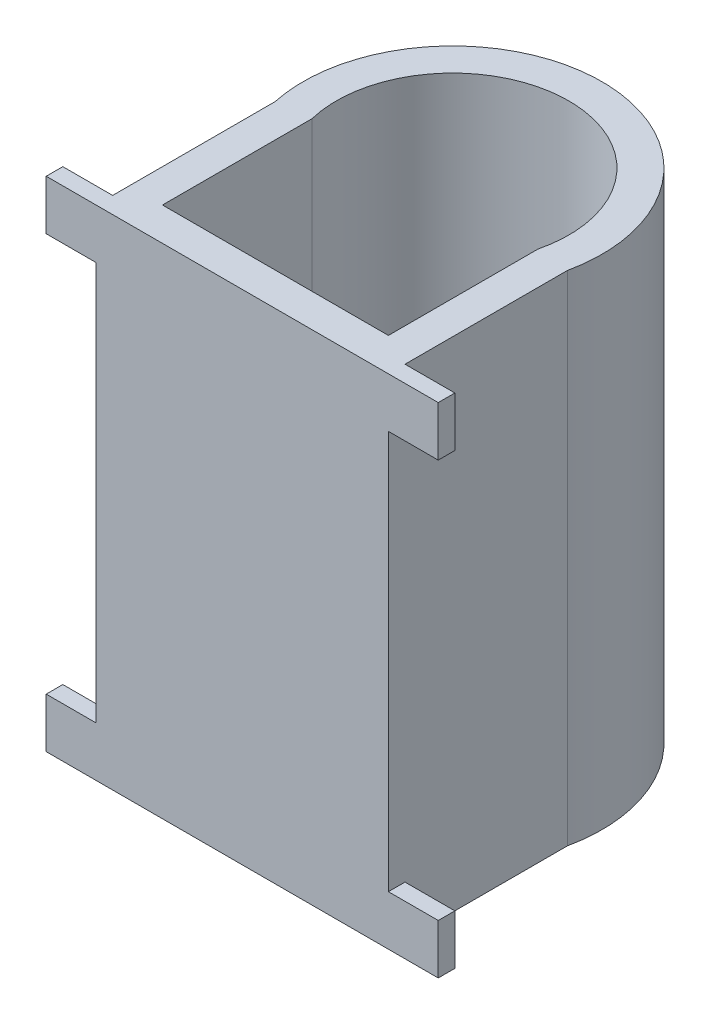
ISO-10303-21;
HEADER;
FILE_DESCRIPTION(('STEP AP214'),'2;1');
FILE_NAME('part.step','',(''),(''),'','','');
FILE_SCHEMA(('AUTOMOTIVE_DESIGN { 1 0 10303 214 1 1 1 1 }'));
ENDSEC;
DATA;
#1=APPLICATION_CONTEXT('core data for automotive mechanical design processes');
#2=APPLICATION_PROTOCOL_DEFINITION('international standard','automotive_design',2000,#1);
#3=PRODUCT_CONTEXT('',#1,'mechanical');
#4=PRODUCT('Part','Part','',(#3));
#5=PRODUCT_RELATED_PRODUCT_CATEGORY('part','',(#4));
#6=PRODUCT_DEFINITION_FORMATION('','',#4);
#7=PRODUCT_DEFINITION_CONTEXT('part definition',#1,'design');
#8=PRODUCT_DEFINITION('design','',#6,#7);
#9=PRODUCT_DEFINITION_SHAPE('','',#8);
#10=(LENGTH_UNIT() NAMED_UNIT(*) SI_UNIT(.MILLI.,.METRE.));
#11=(NAMED_UNIT(*) PLANE_ANGLE_UNIT() SI_UNIT($,.RADIAN.));
#12=(NAMED_UNIT(*) SI_UNIT($,.STERADIAN.) SOLID_ANGLE_UNIT());
#13=UNCERTAINTY_MEASURE_WITH_UNIT(LENGTH_MEASURE(1.E-05),#10,'distance_accuracy_value','');
#14=(GEOMETRIC_REPRESENTATION_CONTEXT(3) GLOBAL_UNCERTAINTY_ASSIGNED_CONTEXT((#13)) GLOBAL_UNIT_ASSIGNED_CONTEXT((#10,
#11,#12)) REPRESENTATION_CONTEXT('',''));
#15=CARTESIAN_POINT('',(0.,0.,0.));
#16=DIRECTION('',(0.,0.,1.));
#17=DIRECTION('',(1.,0.,0.));
#18=AXIS2_PLACEMENT_3D('',#15,#16,#17);
#19=CARTESIAN_POINT('',(40.4131170098748,150.,22.5));
#20=DIRECTION('',(-1.,0.,0.));
#21=DIRECTION('',(0.,0.,1.));
#22=AXIS2_PLACEMENT_3D('',#19,#20,#21);
#23=PLANE('',#22);
#24=DIRECTION('',(0.,0.,1.));
#25=VECTOR('',#24,1.);
#26=CARTESIAN_POINT('',(40.4131170098748,15.,27.5));
#27=LINE('',#26,#25);
#28=CARTESIAN_POINT('',(40.4131170098748,15.,27.5));
#29=VERTEX_POINT('',#28);
#30=CARTESIAN_POINT('',(40.4131170098748,15.,32.5));
#31=VERTEX_POINT('',#30);
#32=EDGE_CURVE('P0_E101',#29,#31,#27,.T.);
#33=ORIENTED_EDGE('',*,*,#32,.F.);
#34=DIRECTION('',(0.,1.,0.));
#35=VECTOR('',#34,1.);
#36=CARTESIAN_POINT('',(40.4131170098748,150.,27.5));
#37=LINE('',#36,#35);
#38=CARTESIAN_POINT('',(40.4131170098748,0.,27.5));
#39=VERTEX_POINT('',#38);
#40=EDGE_CURVE('P0_E105',#39,#29,#37,.T.);
#41=ORIENTED_EDGE('',*,*,#40,.F.);
#42=DIRECTION('',(0.,0.,-1.));
#43=VECTOR('',#42,1.);
#44=CARTESIAN_POINT('',(40.4131170098748,0.,22.5));
#45=LINE('',#44,#43);
#46=CARTESIAN_POINT('',(40.4131170098748,0.,-21.3726427308615));
#47=VERTEX_POINT('',#46);
#48=EDGE_CURVE('P0_E229',#39,#47,#45,.T.);
#49=ORIENTED_EDGE('',*,*,#48,.T.);
#50=DIRECTION('',(0.,-1.,0.));
#51=VECTOR('',#50,1.);
#52=CARTESIAN_POINT('',(40.4131170098748,150.,-21.3726427308615));
#53=LINE('',#52,#51);
#54=CARTESIAN_POINT('',(40.4131170098748,150.,-21.3726427308615));
#55=VERTEX_POINT('',#54);
#56=EDGE_CURVE('P0_E413',#55,#47,#53,.T.);
#57=ORIENTED_EDGE('',*,*,#56,.F.);
#58=DIRECTION('',(0.,0.,-1.));
#59=VECTOR('',#58,1.);
#60=CARTESIAN_POINT('',(40.4131170098748,150.,22.5));
#61=LINE('',#60,#59);
#62=CARTESIAN_POINT('',(40.4131170098748,150.,27.5));
#63=VERTEX_POINT('',#62);
#64=EDGE_CURVE('P0_E410',#63,#55,#61,.T.);
#65=ORIENTED_EDGE('',*,*,#64,.F.);
#66=DIRECTION('',(0.,-1.,0.));
#67=VECTOR('',#66,1.);
#68=CARTESIAN_POINT('',(40.4131170098748,150.,27.5));
#69=LINE('',#68,#67);
#70=CARTESIAN_POINT('',(40.4131170098748,135.,27.5));
#71=VERTEX_POINT('',#70);
#72=EDGE_CURVE('P0_E304',#63,#71,#69,.T.);
#73=ORIENTED_EDGE('',*,*,#72,.T.);
#74=DIRECTION('',(0.,0.,1.));
#75=VECTOR('',#74,1.);
#76=CARTESIAN_POINT('',(40.4131170098748,135.,27.5));
#77=LINE('',#76,#75);
#78=CARTESIAN_POINT('',(40.4131170098748,135.,32.5));
#79=VERTEX_POINT('',#78);
#80=EDGE_CURVE('P0_E288',#71,#79,#77,.T.);
#81=ORIENTED_EDGE('',*,*,#80,.T.);
#82=DIRECTION('',(0.,-1.,0.));
#83=VECTOR('',#82,1.);
#84=CARTESIAN_POINT('',(40.4131170098748,150.,32.5));
#85=LINE('',#84,#83);
#86=EDGE_CURVE('P0_E429',#79,#31,#85,.T.);
#87=ORIENTED_EDGE('',*,*,#86,.T.);
#88=EDGE_LOOP('',(#33,#41,#49,#57,#65,#73,#81,#87));
#89=FACE_BOUND('',#88,.T.);
#90=ADVANCED_FACE('P0_F85',(#89),#23,.F.);
#91=CARTESIAN_POINT('',(-47.5868829901252,150.,22.5));
#92=DIRECTION('',(1.,0.,0.));
#93=DIRECTION('',(0.,0.,-1.));
#94=AXIS2_PLACEMENT_3D('',#91,#92,#93);
#95=PLANE('',#94);
#96=DIRECTION('',(0.,0.,1.));
#97=VECTOR('',#96,1.);
#98=CARTESIAN_POINT('',(-47.5868829901252,15.,27.5));
#99=LINE('',#98,#97);
#100=CARTESIAN_POINT('',(-47.5868829901252,15.,27.5));
#101=VERTEX_POINT('',#100);
#102=CARTESIAN_POINT('',(-47.5868829901252,15.,32.5));
#103=VERTEX_POINT('',#102);
#104=EDGE_CURVE('P0_E279',#101,#103,#99,.T.);
#105=ORIENTED_EDGE('',*,*,#104,.T.);
#106=DIRECTION('',(0.,-1.,0.));
#107=VECTOR('',#106,1.);
#108=CARTESIAN_POINT('',(-47.5868829901252,150.,32.5));
#109=LINE('',#108,#107);
#110=CARTESIAN_POINT('',(-47.5868829901252,135.,32.5));
#111=VERTEX_POINT('',#110);
#112=EDGE_CURVE('P0_E94',#111,#103,#109,.T.);
#113=ORIENTED_EDGE('',*,*,#112,.F.);
#114=DIRECTION('',(0.,0.,1.));
#115=VECTOR('',#114,1.);
#116=CARTESIAN_POINT('',(-47.5868829901252,135.,27.5));
#117=LINE('',#116,#115);
#118=CARTESIAN_POINT('',(-47.5868829901252,135.,27.5));
#119=VERTEX_POINT('',#118);
#120=EDGE_CURVE('P0_E345',#119,#111,#117,.T.);
#121=ORIENTED_EDGE('',*,*,#120,.F.);
#122=DIRECTION('',(0.,1.,0.));
#123=VECTOR('',#122,1.);
#124=CARTESIAN_POINT('',(-47.5868829901252,150.,27.5));
#125=LINE('',#124,#123);
#126=CARTESIAN_POINT('',(-47.5868829901252,150.,27.5));
#127=VERTEX_POINT('',#126);
#128=EDGE_CURVE('P0_E322',#119,#127,#125,.T.);
#129=ORIENTED_EDGE('',*,*,#128,.T.);
#130=DIRECTION('',(0.,0.,1.));
#131=VECTOR('',#130,1.);
#132=CARTESIAN_POINT('',(-47.5868829901252,150.,22.5));
#133=LINE('',#132,#131);
#134=CARTESIAN_POINT('',(-47.5868829901252,150.,-21.3726427308615));
#135=VERTEX_POINT('',#134);
#136=EDGE_CURVE('P0_E403',#135,#127,#133,.T.);
#137=ORIENTED_EDGE('',*,*,#136,.F.);
#138=DIRECTION('',(0.,-1.,0.));
#139=VECTOR('',#138,1.);
#140=CARTESIAN_POINT('',(-47.5868829901252,150.,-21.3726427308615));
#141=LINE('',#140,#139);
#142=CARTESIAN_POINT('',(-47.5868829901252,0.,-21.3726427308615));
#143=VERTEX_POINT('',#142);
#144=EDGE_CURVE('P0_E14',#135,#143,#141,.T.);
#145=ORIENTED_EDGE('',*,*,#144,.T.);
#146=DIRECTION('',(0.,0.,1.));
#147=VECTOR('',#146,1.);
#148=CARTESIAN_POINT('',(-47.5868829901252,0.,22.5));
#149=LINE('',#148,#147);
#150=CARTESIAN_POINT('',(-47.5868829901252,0.,27.5));
#151=VERTEX_POINT('',#150);
#152=EDGE_CURVE('P0_E417',#143,#151,#149,.T.);
#153=ORIENTED_EDGE('',*,*,#152,.T.);
#154=DIRECTION('',(0.,-1.,0.));
#155=VECTOR('',#154,1.);
#156=CARTESIAN_POINT('',(-47.5868829901252,150.,27.5));
#157=LINE('',#156,#155);
#158=EDGE_CURVE('P0_E267',#101,#151,#157,.T.);
#159=ORIENTED_EDGE('',*,*,#158,.F.);
#160=EDGE_LOOP('',(#105,#113,#121,#129,#137,#145,#153,#159));
#161=FACE_BOUND('',#160,.T.);
#162=ADVANCED_FACE('P0_F441',(#161),#95,.F.);
#163=CARTESIAN_POINT('',(-3.58688299012525,150.,-30.8066238629181));
#164=DIRECTION('',(0.,1.,0.));
#165=DIRECTION('',(0.,0.,1.));
#166=AXIS2_PLACEMENT_3D('',#163,#164,#165);
#167=PLANE('',#166);
#168=CARTESIAN_POINT('',(-3.58688299012525,150.,-30.8066238629181));
#169=DIRECTION('',(0.,1.,0.));
#170=DIRECTION('',(1.,0.,0.));
#171=AXIS2_PLACEMENT_3D('',#168,#169,#170);
#172=CIRCLE('',#171,45.);
#173=EDGE_CURVE('P0_E399',#55,#135,#172,.T.);
#174=ORIENTED_EDGE('',*,*,#173,.T.);
#175=ORIENTED_EDGE('',*,*,#136,.T.);
#176=DIRECTION('',(-1.,0.,0.));
#177=VECTOR('',#176,1.);
#178=CARTESIAN_POINT('',(30.4131170098748,150.,27.5));
#179=LINE('',#178,#177);
#180=CARTESIAN_POINT('',(-62.5868829901252,150.,27.5));
#181=VERTEX_POINT('',#180);
#182=EDGE_CURVE('P0_E326',#127,#181,#179,.T.);
#183=ORIENTED_EDGE('',*,*,#182,.T.);
#184=DIRECTION('',(0.,0.,1.));
#185=VECTOR('',#184,1.);
#186=CARTESIAN_POINT('',(-62.5868829901252,150.,27.5));
#187=LINE('',#186,#185);
#188=CARTESIAN_POINT('',(-62.5868829901252,150.,32.5));
#189=VERTEX_POINT('',#188);
#190=EDGE_CURVE('P0_E339',#181,#189,#187,.T.);
#191=ORIENTED_EDGE('',*,*,#190,.T.);
#192=DIRECTION('',(1.,0.,0.));
#193=VECTOR('',#192,1.);
#194=CARTESIAN_POINT('',(30.4131170098748,150.,32.5));
#195=LINE('',#194,#193);
#196=CARTESIAN_POINT('',(55.4131170098748,150.,32.5));
#197=VERTEX_POINT('',#196);
#198=EDGE_CURVE('P0_E407',#189,#197,#195,.T.);
#199=ORIENTED_EDGE('',*,*,#198,.T.);
#200=DIRECTION('',(0.,0.,1.));
#201=VECTOR('',#200,1.);
#202=CARTESIAN_POINT('',(55.4131170098748,150.,27.5));
#203=LINE('',#202,#201);
#204=CARTESIAN_POINT('',(55.4131170098748,150.,27.5));
#205=VERTEX_POINT('',#204);
#206=EDGE_CURVE('P0_E287',#205,#197,#203,.T.);
#207=ORIENTED_EDGE('',*,*,#206,.F.);
#208=DIRECTION('',(-1.,0.,0.));
#209=VECTOR('',#208,1.);
#210=CARTESIAN_POINT('',(30.4131170098748,150.,27.5));
#211=LINE('',#210,#209);
#212=EDGE_CURVE('P0_E292',#205,#63,#211,.T.);
#213=ORIENTED_EDGE('',*,*,#212,.T.);
#214=ORIENTED_EDGE('',*,*,#64,.T.);
#215=EDGE_LOOP('',(#174,#175,#183,#191,#199,#207,#213,#214));
#216=FACE_BOUND('',#215,.T.);
#217=DIRECTION('',(0.,0.,1.));
#218=VECTOR('',#217,1.);
#219=CARTESIAN_POINT('',(-37.5868829901252,150.,22.5));
#220=LINE('',#219,#218);
#221=CARTESIAN_POINT('',(-37.5868829901252,150.,-22.5));
#222=VERTEX_POINT('',#221);
#223=CARTESIAN_POINT('',(-37.5868829901252,150.,22.5));
#224=VERTEX_POINT('',#223);
#225=EDGE_CURVE('P0_E359',#222,#224,#220,.T.);
#226=ORIENTED_EDGE('',*,*,#225,.F.);
#227=CARTESIAN_POINT('',(-3.58688299012525,150.,-30.8066238629181));
#228=DIRECTION('',(0.,1.,0.));
#229=DIRECTION('',(0.,0.,1.));
#230=AXIS2_PLACEMENT_3D('',#227,#228,#229);
#231=CIRCLE('',#230,35.);
#232=CARTESIAN_POINT('',(30.4131170098748,150.,-22.5));
#233=VERTEX_POINT('',#232);
#234=EDGE_CURVE('P0_E356',#233,#222,#231,.T.);
#235=ORIENTED_EDGE('',*,*,#234,.F.);
#236=DIRECTION('',(0.,0.,-1.));
#237=VECTOR('',#236,1.);
#238=CARTESIAN_POINT('',(30.4131170098748,150.,22.5));
#239=LINE('',#238,#237);
#240=CARTESIAN_POINT('',(30.4131170098748,150.,22.5));
#241=VERTEX_POINT('',#240);
#242=EDGE_CURVE('P0_E367',#241,#233,#239,.T.);
#243=ORIENTED_EDGE('',*,*,#242,.F.);
#244=DIRECTION('',(1.,0.,0.));
#245=VECTOR('',#244,1.);
#246=CARTESIAN_POINT('',(30.4131170098748,150.,22.5));
#247=LINE('',#246,#245);
#248=EDGE_CURVE('P0_E363',#224,#241,#247,.T.);
#249=ORIENTED_EDGE('',*,*,#248,.F.);
#250=EDGE_LOOP('',(#226,#235,#243,#249));
#251=FACE_BOUND('',#250,.T.);
#252=ADVANCED_FACE('P0_F469',(#216,#251),#167,.T.);
#253=CARTESIAN_POINT('',(-3.58688299012525,0.,-30.8066238629181));
#254=DIRECTION('',(0.,1.,0.));
#255=DIRECTION('',(0.,0.,1.));
#256=AXIS2_PLACEMENT_3D('',#253,#254,#255);
#257=PLANE('',#256);
#258=CARTESIAN_POINT('',(-3.58688299012525,0.,-30.8066238629181));
#259=DIRECTION('',(0.,1.,0.));
#260=DIRECTION('',(1.,0.,0.));
#261=AXIS2_PLACEMENT_3D('',#258,#259,#260);
#262=CIRCLE('',#261,45.);
#263=EDGE_CURVE('P0_E398',#47,#143,#262,.T.);
#264=ORIENTED_EDGE('',*,*,#263,.F.);
#265=ORIENTED_EDGE('',*,*,#48,.F.);
#266=DIRECTION('',(-1.,0.,0.));
#267=VECTOR('',#266,1.);
#268=CARTESIAN_POINT('',(30.4131170098748,0.,27.5));
#269=LINE('',#268,#267);
#270=CARTESIAN_POINT('',(55.4131170098748,0.,27.5));
#271=VERTEX_POINT('',#270);
#272=EDGE_CURVE('P0_E221',#271,#39,#269,.T.);
#273=ORIENTED_EDGE('',*,*,#272,.F.);
#274=DIRECTION('',(0.,0.,1.));
#275=VECTOR('',#274,1.);
#276=CARTESIAN_POINT('',(55.4131170098748,0.,27.5));
#277=LINE('',#276,#275);
#278=CARTESIAN_POINT('',(55.4131170098748,0.,32.5));
#279=VERTEX_POINT('',#278);
#280=EDGE_CURVE('P0_E227',#271,#279,#277,.T.);
#281=ORIENTED_EDGE('',*,*,#280,.T.);
#282=DIRECTION('',(1.,0.,0.));
#283=VECTOR('',#282,1.);
#284=CARTESIAN_POINT('',(30.4131170098748,0.,32.5));
#285=LINE('',#284,#283);
#286=CARTESIAN_POINT('',(-62.5868829901252,0.,32.5));
#287=VERTEX_POINT('',#286);
#288=EDGE_CURVE('P0_E421',#287,#279,#285,.T.);
#289=ORIENTED_EDGE('',*,*,#288,.F.);
#290=DIRECTION('',(0.,0.,1.));
#291=VECTOR('',#290,1.);
#292=CARTESIAN_POINT('',(-62.5868829901252,0.,27.5));
#293=LINE('',#292,#291);
#294=CARTESIAN_POINT('',(-62.5868829901252,0.,27.5));
#295=VERTEX_POINT('',#294);
#296=EDGE_CURVE('P0_E272',#295,#287,#293,.T.);
#297=ORIENTED_EDGE('',*,*,#296,.F.);
#298=DIRECTION('',(-1.,0.,0.));
#299=VECTOR('',#298,1.);
#300=CARTESIAN_POINT('',(30.4131170098748,0.,27.5));
#301=LINE('',#300,#299);
#302=EDGE_CURVE('P0_E270',#151,#295,#301,.T.);
#303=ORIENTED_EDGE('',*,*,#302,.F.);
#304=ORIENTED_EDGE('',*,*,#152,.F.);
#305=EDGE_LOOP('',(#264,#265,#273,#281,#289,#297,#303,#304));
#306=FACE_BOUND('',#305,.T.);
#307=CARTESIAN_POINT('',(-3.58688299012525,0.,-30.8066238629181));
#308=DIRECTION('',(0.,1.,0.));
#309=DIRECTION('',(0.,0.,1.));
#310=AXIS2_PLACEMENT_3D('',#307,#308,#309);
#311=CIRCLE('',#310,35.);
#312=CARTESIAN_POINT('',(30.4131170098748,0.,-22.5));
#313=VERTEX_POINT('',#312);
#314=CARTESIAN_POINT('',(-37.5868829901252,0.,-22.5));
#315=VERTEX_POINT('',#314);
#316=EDGE_CURVE('P0_E349',#313,#315,#311,.T.);
#317=ORIENTED_EDGE('',*,*,#316,.T.);
#318=DIRECTION('',(0.,0.,1.));
#319=VECTOR('',#318,1.);
#320=CARTESIAN_POINT('',(-37.5868829901252,0.,22.5));
#321=LINE('',#320,#319);
#322=CARTESIAN_POINT('',(-37.5868829901252,0.,22.5));
#323=VERTEX_POINT('',#322);
#324=EDGE_CURVE('P0_E374',#315,#323,#321,.T.);
#325=ORIENTED_EDGE('',*,*,#324,.T.);
#326=DIRECTION('',(1.,0.,0.));
#327=VECTOR('',#326,1.);
#328=CARTESIAN_POINT('',(30.4131170098748,0.,22.5));
#329=LINE('',#328,#327);
#330=CARTESIAN_POINT('',(30.4131170098748,0.,22.5));
#331=VERTEX_POINT('',#330);
#332=EDGE_CURVE('P0_E378',#323,#331,#329,.T.);
#333=ORIENTED_EDGE('',*,*,#332,.T.);
#334=DIRECTION('',(0.,0.,-1.));
#335=VECTOR('',#334,1.);
#336=CARTESIAN_POINT('',(30.4131170098748,0.,22.5));
#337=LINE('',#336,#335);
#338=EDGE_CURVE('P0_E360',#331,#313,#337,.T.);
#339=ORIENTED_EDGE('',*,*,#338,.T.);
#340=EDGE_LOOP('',(#317,#325,#333,#339));
#341=FACE_BOUND('',#340,.T.);
#342=ADVANCED_FACE('P0_F224',(#306,#341),#257,.F.);
#343=CARTESIAN_POINT('',(-3.58688299012525,150.,-30.8066238629181));
#344=DIRECTION('',(0.,-1.,0.));
#345=DIRECTION('',(0.,0.,-1.));
#346=AXIS2_PLACEMENT_3D('',#343,#344,#345);
#347=CYLINDRICAL_SURFACE('',#346,45.);
#348=ORIENTED_EDGE('',*,*,#263,.T.);
#349=ORIENTED_EDGE('',*,*,#144,.F.);
#350=ORIENTED_EDGE('',*,*,#173,.F.);
#351=ORIENTED_EDGE('',*,*,#56,.T.);
#352=EDGE_LOOP('',(#348,#349,#350,#351));
#353=FACE_BOUND('',#352,.T.);
#354=ADVANCED_FACE('P0_F87',(#353),#347,.T.);
#355=CARTESIAN_POINT('',(30.4131170098748,150.,32.5));
#356=DIRECTION('',(0.,0.,-1.));
#357=DIRECTION('',(-1.,0.,0.));
#358=AXIS2_PLACEMENT_3D('',#355,#356,#357);
#359=PLANE('',#358);
#360=ORIENTED_EDGE('',*,*,#288,.T.);
#361=DIRECTION('',(0.,-1.,0.));
#362=VECTOR('',#361,1.);
#363=CARTESIAN_POINT('',(55.4131170098748,150.,32.5));
#364=LINE('',#363,#362);
#365=CARTESIAN_POINT('',(55.4131170098748,15.,32.5));
#366=VERTEX_POINT('',#365);
#367=EDGE_CURVE('P0_E246',#366,#279,#364,.T.);
#368=ORIENTED_EDGE('',*,*,#367,.F.);
#369=DIRECTION('',(1.,0.,0.));
#370=VECTOR('',#369,1.);
#371=CARTESIAN_POINT('',(30.413117009875,15.,32.5));
#372=LINE('',#371,#370);
#373=EDGE_CURVE('P0_E242',#31,#366,#372,.T.);
#374=ORIENTED_EDGE('',*,*,#373,.F.);
#375=ORIENTED_EDGE('',*,*,#86,.F.);
#376=DIRECTION('',(1.,0.,0.));
#377=VECTOR('',#376,1.);
#378=CARTESIAN_POINT('',(30.4131170098747,135.,32.5));
#379=LINE('',#378,#377);
#380=CARTESIAN_POINT('',(55.4131170098748,135.,32.5));
#381=VERTEX_POINT('',#380);
#382=EDGE_CURVE('P0_E303',#79,#381,#379,.T.);
#383=ORIENTED_EDGE('',*,*,#382,.T.);
#384=DIRECTION('',(0.,1.,0.));
#385=VECTOR('',#384,1.);
#386=CARTESIAN_POINT('',(55.4131170098748,150.,32.5));
#387=LINE('',#386,#385);
#388=EDGE_CURVE('P0_E299',#381,#197,#387,.T.);
#389=ORIENTED_EDGE('',*,*,#388,.T.);
#390=ORIENTED_EDGE('',*,*,#198,.F.);
#391=DIRECTION('',(0.,-1.,0.));
#392=VECTOR('',#391,1.);
#393=CARTESIAN_POINT('',(-62.5868829901252,150.,32.5));
#394=LINE('',#393,#392);
#395=CARTESIAN_POINT('',(-62.5868829901252,135.,32.5));
#396=VERTEX_POINT('',#395);
#397=EDGE_CURVE('P0_E308',#189,#396,#394,.T.);
#398=ORIENTED_EDGE('',*,*,#397,.T.);
#399=DIRECTION('',(1.,0.,0.));
#400=VECTOR('',#399,1.);
#401=CARTESIAN_POINT('',(30.4131170098748,135.,32.5));
#402=LINE('',#401,#400);
#403=EDGE_CURVE('P0_E327',#396,#111,#402,.T.);
#404=ORIENTED_EDGE('',*,*,#403,.T.);
#405=ORIENTED_EDGE('',*,*,#112,.T.);
#406=DIRECTION('',(1.,0.,0.));
#407=VECTOR('',#406,1.);
#408=CARTESIAN_POINT('',(30.4131170098745,14.9999999999998,32.5));
#409=LINE('',#408,#407);
#410=CARTESIAN_POINT('',(-62.5868829901252,15.,32.5));
#411=VERTEX_POINT('',#410);
#412=EDGE_CURVE('P0_E254',#411,#103,#409,.T.);
#413=ORIENTED_EDGE('',*,*,#412,.F.);
#414=DIRECTION('',(0.,1.,0.));
#415=VECTOR('',#414,1.);
#416=CARTESIAN_POINT('',(-62.5868829901252,150.,32.5));
#417=LINE('',#416,#415);
#418=EDGE_CURVE('P0_E248',#287,#411,#417,.T.);
#419=ORIENTED_EDGE('',*,*,#418,.F.);
#420=EDGE_LOOP('',(#360,#368,#374,#375,#383,#389,#390,#398,#404,#405,#413,#419));
#421=FACE_BOUND('',#420,.T.);
#422=ADVANCED_FACE('P0_F436',(#421),#359,.F.);
#423=CARTESIAN_POINT('',(-3.58688299012525,150.,-30.8066238629181));
#424=DIRECTION('',(0.,-1.,0.));
#425=DIRECTION('',(0.,0.,-1.));
#426=AXIS2_PLACEMENT_3D('',#423,#424,#425);
#427=CYLINDRICAL_SURFACE('',#426,35.);
#428=ORIENTED_EDGE('',*,*,#316,.F.);
#429=DIRECTION('',(0.,-1.,0.));
#430=VECTOR('',#429,1.);
#431=CARTESIAN_POINT('',(30.4131170098748,150.,-22.5));
#432=LINE('',#431,#430);
#433=EDGE_CURVE('P0_E370',#233,#313,#432,.T.);
#434=ORIENTED_EDGE('',*,*,#433,.F.);
#435=ORIENTED_EDGE('',*,*,#234,.T.);
#436=DIRECTION('',(0.,-1.,0.));
#437=VECTOR('',#436,1.);
#438=CARTESIAN_POINT('',(-37.5868829901252,150.,-22.5));
#439=LINE('',#438,#437);
#440=EDGE_CURVE('P0_E394',#222,#315,#439,.T.);
#441=ORIENTED_EDGE('',*,*,#440,.T.);
#442=EDGE_LOOP('',(#428,#434,#435,#441));
#443=FACE_BOUND('',#442,.T.);
#444=ADVANCED_FACE('P0_F474',(#443),#427,.F.);
#445=CARTESIAN_POINT('',(-37.5868829901252,150.,22.5));
#446=DIRECTION('',(1.,0.,0.));
#447=DIRECTION('',(0.,0.,-1.));
#448=AXIS2_PLACEMENT_3D('',#445,#446,#447);
#449=PLANE('',#448);
#450=ORIENTED_EDGE('',*,*,#324,.F.);
#451=ORIENTED_EDGE('',*,*,#440,.F.);
#452=ORIENTED_EDGE('',*,*,#225,.T.);
#453=DIRECTION('',(0.,-1.,0.));
#454=VECTOR('',#453,1.);
#455=CARTESIAN_POINT('',(-37.5868829901252,150.,22.5));
#456=LINE('',#455,#454);
#457=EDGE_CURVE('P0_E391',#224,#323,#456,.T.);
#458=ORIENTED_EDGE('',*,*,#457,.T.);
#459=EDGE_LOOP('',(#450,#451,#452,#458));
#460=FACE_BOUND('',#459,.T.);
#461=ADVANCED_FACE('P0_F479',(#460),#449,.T.);
#462=CARTESIAN_POINT('',(30.4131170098748,150.,22.5));
#463=DIRECTION('',(0.,0.,-1.));
#464=DIRECTION('',(-1.,0.,0.));
#465=AXIS2_PLACEMENT_3D('',#462,#463,#464);
#466=PLANE('',#465);
#467=ORIENTED_EDGE('',*,*,#332,.F.);
#468=ORIENTED_EDGE('',*,*,#457,.F.);
#469=ORIENTED_EDGE('',*,*,#248,.T.);
#470=DIRECTION('',(0.,-1.,0.));
#471=VECTOR('',#470,1.);
#472=CARTESIAN_POINT('',(30.4131170098748,150.,22.5));
#473=LINE('',#472,#471);
#474=EDGE_CURVE('P0_E388',#241,#331,#473,.T.);
#475=ORIENTED_EDGE('',*,*,#474,.T.);
#476=EDGE_LOOP('',(#467,#468,#469,#475));
#477=FACE_BOUND('',#476,.T.);
#478=ADVANCED_FACE('P0_F735',(#477),#466,.T.);
#479=CARTESIAN_POINT('',(30.4131170098748,150.,22.5));
#480=DIRECTION('',(-1.,0.,0.));
#481=DIRECTION('',(0.,0.,1.));
#482=AXIS2_PLACEMENT_3D('',#479,#480,#481);
#483=PLANE('',#482);
#484=ORIENTED_EDGE('',*,*,#338,.F.);
#485=ORIENTED_EDGE('',*,*,#474,.F.);
#486=ORIENTED_EDGE('',*,*,#242,.T.);
#487=ORIENTED_EDGE('',*,*,#433,.T.);
#488=EDGE_LOOP('',(#484,#485,#486,#487));
#489=FACE_BOUND('',#488,.T.);
#490=ADVANCED_FACE('P0_F724',(#489),#483,.T.);
#491=CARTESIAN_POINT('',(30.4131170098748,135.,27.5));
#492=DIRECTION('',(0.,-1.,0.));
#493=DIRECTION('',(1.,0.,0.));
#494=AXIS2_PLACEMENT_3D('',#491,#492,#493);
#495=PLANE('',#494);
#496=ORIENTED_EDGE('',*,*,#403,.F.);
#497=DIRECTION('',(0.,0.,1.));
#498=VECTOR('',#497,1.);
#499=CARTESIAN_POINT('',(-62.5868829901252,135.,27.5));
#500=LINE('',#499,#498);
#501=CARTESIAN_POINT('',(-62.5868829901252,135.,27.5));
#502=VERTEX_POINT('',#501);
#503=EDGE_CURVE('P0_E350',#502,#396,#500,.T.);
#504=ORIENTED_EDGE('',*,*,#503,.F.);
#505=DIRECTION('',(1.,0.,0.));
#506=VECTOR('',#505,1.);
#507=CARTESIAN_POINT('',(30.4131170098748,135.,27.5));
#508=LINE('',#507,#506);
#509=EDGE_CURVE('P0_E335',#502,#119,#508,.T.);
#510=ORIENTED_EDGE('',*,*,#509,.T.);
#511=ORIENTED_EDGE('',*,*,#120,.T.);
#512=EDGE_LOOP('',(#496,#504,#510,#511));
#513=FACE_BOUND('',#512,.T.);
#514=ADVANCED_FACE('P0_F714',(#513),#495,.T.);
#515=CARTESIAN_POINT('',(-62.5868829901252,150.,27.5));
#516=DIRECTION('',(-1.,0.,0.));
#517=DIRECTION('',(0.,0.,1.));
#518=AXIS2_PLACEMENT_3D('',#515,#516,#517);
#519=PLANE('',#518);
#520=ORIENTED_EDGE('',*,*,#397,.F.);
#521=ORIENTED_EDGE('',*,*,#190,.F.);
#522=DIRECTION('',(0.,-1.,0.));
#523=VECTOR('',#522,1.);
#524=CARTESIAN_POINT('',(-62.5868829901252,150.,27.5));
#525=LINE('',#524,#523);
#526=EDGE_CURVE('P0_E331',#181,#502,#525,.T.);
#527=ORIENTED_EDGE('',*,*,#526,.T.);
#528=ORIENTED_EDGE('',*,*,#503,.T.);
#529=EDGE_LOOP('',(#520,#521,#527,#528));
#530=FACE_BOUND('',#529,.T.);
#531=ADVANCED_FACE('P0_F704',(#530),#519,.T.);
#532=CARTESIAN_POINT('',(0.,0.,27.5));
#533=DIRECTION('',(0.,0.,1.));
#534=DIRECTION('',(1.,0.,0.));
#535=AXIS2_PLACEMENT_3D('',#532,#533,#534);
#536=PLANE('',#535);
#537=ORIENTED_EDGE('',*,*,#128,.F.);
#538=ORIENTED_EDGE('',*,*,#509,.F.);
#539=ORIENTED_EDGE('',*,*,#526,.F.);
#540=ORIENTED_EDGE('',*,*,#182,.F.);
#541=EDGE_LOOP('',(#537,#538,#539,#540));
#542=FACE_BOUND('',#541,.T.);
#543=ADVANCED_FACE('P0_F694',(#542),#536,.F.);
#544=CARTESIAN_POINT('',(55.4131170098748,150.,27.5));
#545=DIRECTION('',(1.,0.,0.));
#546=DIRECTION('',(0.,0.,-1.));
#547=AXIS2_PLACEMENT_3D('',#544,#545,#546);
#548=PLANE('',#547);
#549=ORIENTED_EDGE('',*,*,#388,.F.);
#550=DIRECTION('',(0.,0.,1.));
#551=VECTOR('',#550,1.);
#552=CARTESIAN_POINT('',(55.4131170098748,135.,27.5));
#553=LINE('',#552,#551);
#554=CARTESIAN_POINT('',(55.4131170098748,135.,27.5));
#555=VERTEX_POINT('',#554);
#556=EDGE_CURVE('P0_E293',#555,#381,#553,.T.);
#557=ORIENTED_EDGE('',*,*,#556,.F.);
#558=DIRECTION('',(0.,1.,0.));
#559=VECTOR('',#558,1.);
#560=CARTESIAN_POINT('',(55.4131170098748,150.,27.5));
#561=LINE('',#560,#559);
#562=EDGE_CURVE('P0_E312',#555,#205,#561,.T.);
#563=ORIENTED_EDGE('',*,*,#562,.T.);
#564=ORIENTED_EDGE('',*,*,#206,.T.);
#565=EDGE_LOOP('',(#549,#557,#563,#564));
#566=FACE_BOUND('',#565,.T.);
#567=ADVANCED_FACE('P0_F685',(#566),#548,.T.);
#568=CARTESIAN_POINT('',(30.4131170098747,135.,27.5));
#569=DIRECTION('',(0.,-1.,0.));
#570=DIRECTION('',(1.,0.,0.));
#571=AXIS2_PLACEMENT_3D('',#568,#569,#570);
#572=PLANE('',#571);
#573=ORIENTED_EDGE('',*,*,#382,.F.);
#574=ORIENTED_EDGE('',*,*,#80,.F.);
#575=DIRECTION('',(1.,0.,0.));
#576=VECTOR('',#575,1.);
#577=CARTESIAN_POINT('',(30.4131170098747,135.,27.5));
#578=LINE('',#577,#576);
#579=EDGE_CURVE('P0_E316',#71,#555,#578,.T.);
#580=ORIENTED_EDGE('',*,*,#579,.T.);
#581=ORIENTED_EDGE('',*,*,#556,.T.);
#582=EDGE_LOOP('',(#573,#574,#580,#581));
#583=FACE_BOUND('',#582,.T.);
#584=ADVANCED_FACE('P0_F500',(#583),#572,.T.);
#585=CARTESIAN_POINT('',(0.,0.,27.5));
#586=DIRECTION('',(0.,0.,1.));
#587=DIRECTION('',(1.,0.,0.));
#588=AXIS2_PLACEMENT_3D('',#585,#586,#587);
#589=PLANE('',#588);
#590=ORIENTED_EDGE('',*,*,#72,.F.);
#591=ORIENTED_EDGE('',*,*,#212,.F.);
#592=ORIENTED_EDGE('',*,*,#562,.F.);
#593=ORIENTED_EDGE('',*,*,#579,.F.);
#594=EDGE_LOOP('',(#590,#591,#592,#593));
#595=FACE_BOUND('',#594,.T.);
#596=ADVANCED_FACE('P0_F496',(#595),#589,.F.);
#597=CARTESIAN_POINT('',(-62.5868829901252,150.,27.5));
#598=DIRECTION('',(1.,0.,0.));
#599=DIRECTION('',(0.,0.,-1.));
#600=AXIS2_PLACEMENT_3D('',#597,#598,#599);
#601=PLANE('',#600);
#602=ORIENTED_EDGE('',*,*,#418,.T.);
#603=DIRECTION('',(0.,0.,1.));
#604=VECTOR('',#603,1.);
#605=CARTESIAN_POINT('',(-62.5868829901252,15.,27.5));
#606=LINE('',#605,#604);
#607=CARTESIAN_POINT('',(-62.5868829901252,15.,27.5));
#608=VERTEX_POINT('',#607);
#609=EDGE_CURVE('P0_E283',#608,#411,#606,.T.);
#610=ORIENTED_EDGE('',*,*,#609,.F.);
#611=DIRECTION('',(0.,1.,0.));
#612=VECTOR('',#611,1.);
#613=CARTESIAN_POINT('',(-62.5868829901252,150.,27.5));
#614=LINE('',#613,#612);
#615=EDGE_CURVE('P0_E260',#295,#608,#614,.T.);
#616=ORIENTED_EDGE('',*,*,#615,.F.);
#617=ORIENTED_EDGE('',*,*,#296,.T.);
#618=EDGE_LOOP('',(#602,#610,#616,#617));
#619=FACE_BOUND('',#618,.T.);
#620=ADVANCED_FACE('P0_F449',(#619),#601,.F.);
#621=CARTESIAN_POINT('',(30.4131170098745,14.9999999999998,27.5));
#622=DIRECTION('',(0.,-1.,0.));
#623=DIRECTION('',(1.,0.,0.));
#624=AXIS2_PLACEMENT_3D('',#621,#622,#623);
#625=PLANE('',#624);
#626=ORIENTED_EDGE('',*,*,#412,.T.);
#627=ORIENTED_EDGE('',*,*,#104,.F.);
#628=DIRECTION('',(1.,0.,0.));
#629=VECTOR('',#628,1.);
#630=CARTESIAN_POINT('',(30.4131170098745,14.9999999999998,27.5));
#631=LINE('',#630,#629);
#632=EDGE_CURVE('P0_E264',#608,#101,#631,.T.);
#633=ORIENTED_EDGE('',*,*,#632,.F.);
#634=ORIENTED_EDGE('',*,*,#609,.T.);
#635=EDGE_LOOP('',(#626,#627,#633,#634));
#636=FACE_BOUND('',#635,.T.);
#637=ADVANCED_FACE('P0_F445',(#636),#625,.F.);
#638=CARTESIAN_POINT('',(0.,0.,27.5));
#639=DIRECTION('',(0.,0.,-1.));
#640=DIRECTION('',(-1.,0.,0.));
#641=AXIS2_PLACEMENT_3D('',#638,#639,#640);
#642=PLANE('',#641);
#643=ORIENTED_EDGE('',*,*,#615,.T.);
#644=ORIENTED_EDGE('',*,*,#632,.T.);
#645=ORIENTED_EDGE('',*,*,#158,.T.);
#646=ORIENTED_EDGE('',*,*,#302,.T.);
#647=EDGE_LOOP('',(#643,#644,#645,#646));
#648=FACE_BOUND('',#647,.T.);
#649=ADVANCED_FACE('P0_F454',(#648),#642,.T.);
#650=CARTESIAN_POINT('',(55.4131170098748,150.,27.5));
#651=DIRECTION('',(-1.,0.,0.));
#652=DIRECTION('',(0.,0.,1.));
#653=AXIS2_PLACEMENT_3D('',#650,#651,#652);
#654=PLANE('',#653);
#655=ORIENTED_EDGE('',*,*,#367,.T.);
#656=ORIENTED_EDGE('',*,*,#280,.F.);
#657=DIRECTION('',(0.,-1.,0.));
#658=VECTOR('',#657,1.);
#659=CARTESIAN_POINT('',(55.4131170098748,150.,27.5));
#660=LINE('',#659,#658);
#661=CARTESIAN_POINT('',(55.4131170098748,15.,27.5));
#662=VERTEX_POINT('',#661);
#663=EDGE_CURVE('P0_E232',#662,#271,#660,.T.);
#664=ORIENTED_EDGE('',*,*,#663,.F.);
#665=DIRECTION('',(0.,0.,1.));
#666=VECTOR('',#665,1.);
#667=CARTESIAN_POINT('',(55.4131170098748,15.,27.5));
#668=LINE('',#667,#666);
#669=EDGE_CURVE('P0_E256',#662,#366,#668,.T.);
#670=ORIENTED_EDGE('',*,*,#669,.T.);
#671=EDGE_LOOP('',(#655,#656,#664,#670));
#672=FACE_BOUND('',#671,.T.);
#673=ADVANCED_FACE('P0_F244',(#672),#654,.F.);
#674=CARTESIAN_POINT('',(30.413117009875,15.,27.5));
#675=DIRECTION('',(0.,-1.,0.));
#676=DIRECTION('',(1.,0.,0.));
#677=AXIS2_PLACEMENT_3D('',#674,#675,#676);
#678=PLANE('',#677);
#679=ORIENTED_EDGE('',*,*,#373,.T.);
#680=ORIENTED_EDGE('',*,*,#669,.F.);
#681=DIRECTION('',(1.,0.,0.));
#682=VECTOR('',#681,1.);
#683=CARTESIAN_POINT('',(30.413117009875,15.,27.5));
#684=LINE('',#683,#682);
#685=EDGE_CURVE('P0_E237',#29,#662,#684,.T.);
#686=ORIENTED_EDGE('',*,*,#685,.F.);
#687=ORIENTED_EDGE('',*,*,#32,.T.);
#688=EDGE_LOOP('',(#679,#680,#686,#687));
#689=FACE_BOUND('',#688,.T.);
#690=ADVANCED_FACE('P0_F461',(#689),#678,.F.);
#691=CARTESIAN_POINT('',(0.,0.,27.5));
#692=DIRECTION('',(0.,0.,-1.));
#693=DIRECTION('',(-1.,0.,0.));
#694=AXIS2_PLACEMENT_3D('',#691,#692,#693);
#695=PLANE('',#694);
#696=ORIENTED_EDGE('',*,*,#663,.T.);
#697=ORIENTED_EDGE('',*,*,#272,.T.);
#698=ORIENTED_EDGE('',*,*,#40,.T.);
#699=ORIENTED_EDGE('',*,*,#685,.T.);
#700=EDGE_LOOP('',(#696,#697,#698,#699));
#701=FACE_BOUND('',#700,.T.);
#702=ADVANCED_FACE('P0_F235',(#701),#695,.T.);
#703=CLOSED_SHELL('',(#90,#162,#252,#342,#354,#422,#444,#461,#478,#490,#514,#531,#543,#567,#584,
#596,#620,#637,#649,#673,#690,#702));
#704=MANIFOLD_SOLID_BREP('P0_B2',#703);
#705=CARTESIAN_POINT('',(-3.58688299012525,1.0982046843295,-30.8066238629181));
#706=DIRECTION('',(0.,-1.,0.));
#707=DIRECTION('',(0.,0.,-1.));
#708=AXIS2_PLACEMENT_3D('',#705,#706,#707);
#709=CYLINDRICAL_SURFACE('',#708,36.1268566820172);
#710=CARTESIAN_POINT('',(-3.58688299012525,0.001000000000001,-30.8066238629181));
#711=DIRECTION('',(0.,-1.,0.));
#712=DIRECTION('',(-0.972312714772392,0.,0.233683513949832));
#713=AXIS2_PLACEMENT_3D('',#710,#711,#712);
#714=CIRCLE('',#713,36.1268566820172);
#715=CARTESIAN_POINT('',(-38.7134850868105,0.001,-22.3643730455023));
#716=VERTEX_POINT('',#715);
#717=CARTESIAN_POINT('',(31.53971910656,0.001,-22.3643730455023));
#718=VERTEX_POINT('',#717);
#719=EDGE_CURVE('P1_E107',#716,#718,#714,.T.);
#720=ORIENTED_EDGE('',*,*,#719,.F.);
#721=DIRECTION('',(0.,-1.,0.));
#722=VECTOR('',#721,1.);
#723=CARTESIAN_POINT('',(-38.7134850868105,1.0982046843295,-22.3643730455023));
#724=LINE('',#723,#722);
#725=CARTESIAN_POINT('',(-38.7134850868105,1.0982046843295,-22.3643730455023));
#726=VERTEX_POINT('',#725);
#727=EDGE_CURVE('P1_E33',#726,#716,#724,.T.);
#728=ORIENTED_EDGE('',*,*,#727,.F.);
#729=CARTESIAN_POINT('',(-3.58688299012525,1.0982046843295,-30.8066238629181));
#730=DIRECTION('',(0.,-1.,0.));
#731=DIRECTION('',(-0.972312714772392,0.,0.233683513949832));
#732=AXIS2_PLACEMENT_3D('',#729,#730,#731);
#733=CIRCLE('',#732,36.1268566820172);
#734=CARTESIAN_POINT('',(31.53971910656,1.0982046843295,-22.3643730455023));
#735=VERTEX_POINT('',#734);
#736=EDGE_CURVE('P1_E127',#726,#735,#733,.T.);
#737=ORIENTED_EDGE('',*,*,#736,.T.);
#738=DIRECTION('',(0.,-1.,0.));
#739=VECTOR('',#738,1.);
#740=CARTESIAN_POINT('',(31.53971910656,1.0982046843295,-22.3643730455023));
#741=LINE('',#740,#739);
#742=EDGE_CURVE('P1_E11',#735,#718,#741,.T.);
#743=ORIENTED_EDGE('',*,*,#742,.T.);
#744=EDGE_LOOP('',(#720,#728,#737,#743));
#745=FACE_BOUND('',#744,.T.);
#746=ADVANCED_FACE('P1_F16',(#745),#709,.T.);
#747=CARTESIAN_POINT('',(31.5399736918919,1.0982046843295,-22.36434239703));
#748=DIRECTION('',(0.119522860933438,0.,-0.992831448793946));
#749=DIRECTION('',(-0.992831448793946,0.,-0.119522860933438));
#750=AXIS2_PLACEMENT_3D('',#747,#748,#749);
#751=PLANE('',#750);
#752=DIRECTION('',(0.992831448793946,0.,0.119522860933438));
#753=VECTOR('',#752,1.);
#754=CARTESIAN_POINT('',(31.5399736918919,0.001,-22.36434239703));
#755=LINE('',#754,#753);
#756=CARTESIAN_POINT('',(31.5399736918919,0.001,-22.36434239703));
#757=VERTEX_POINT('',#756);
#758=EDGE_CURVE('P1_E111',#718,#757,#755,.T.);
#759=ORIENTED_EDGE('',*,*,#758,.F.);
#760=ORIENTED_EDGE('',*,*,#742,.F.);
#761=DIRECTION('',(0.992831448793946,0.,0.119522860933438));
#762=VECTOR('',#761,1.);
#763=CARTESIAN_POINT('',(31.5399736918919,1.0982046843295,-22.36434239703));
#764=LINE('',#763,#762);
#765=CARTESIAN_POINT('',(31.5399736918919,1.0982046843295,-22.36434239703));
#766=VERTEX_POINT('',#765);
#767=EDGE_CURVE('P1_E137',#735,#766,#764,.T.);
#768=ORIENTED_EDGE('',*,*,#767,.T.);
#769=DIRECTION('',(0.,-1.,0.));
#770=VECTOR('',#769,1.);
#771=CARTESIAN_POINT('',(31.5399736918919,1.0982046843295,-22.36434239703));
#772=LINE('',#771,#770);
#773=EDGE_CURVE('P1_E25',#766,#757,#772,.T.);
#774=ORIENTED_EDGE('',*,*,#773,.T.);
#775=EDGE_LOOP('',(#759,#760,#768,#774));
#776=FACE_BOUND('',#775,.T.);
#777=ADVANCED_FACE('P1_F136',(#776),#751,.T.);
#778=CARTESIAN_POINT('',(31.5399736918919,1.0982046843295,-22.36434239703));
#779=DIRECTION('',(1.,0.,0.));
#780=DIRECTION('',(0.,0.,-1.));
#781=AXIS2_PLACEMENT_3D('',#778,#779,#780);
#782=PLANE('',#781);
#783=DIRECTION('',(0.,0.,1.));
#784=VECTOR('',#783,1.);
#785=CARTESIAN_POINT('',(31.5399736918919,0.001,-22.36434239703));
#786=LINE('',#785,#784);
#787=CARTESIAN_POINT('',(31.5399736918919,0.001,23.6268566820171));
#788=VERTEX_POINT('',#787);
#789=EDGE_CURVE('P1_E115',#757,#788,#786,.T.);
#790=ORIENTED_EDGE('',*,*,#789,.F.);
#791=ORIENTED_EDGE('',*,*,#773,.F.);
#792=DIRECTION('',(0.,0.,1.));
#793=VECTOR('',#792,1.);
#794=CARTESIAN_POINT('',(31.5399736918919,1.0982046843295,-22.36434239703));
#795=LINE('',#794,#793);
#796=CARTESIAN_POINT('',(31.5399736918919,1.0982046843295,23.6268566820171));
#797=VERTEX_POINT('',#796);
#798=EDGE_CURVE('P1_E94',#766,#797,#795,.T.);
#799=ORIENTED_EDGE('',*,*,#798,.T.);
#800=DIRECTION('',(0.,-1.,0.));
#801=VECTOR('',#800,1.);
#802=CARTESIAN_POINT('',(31.5399736918919,1.0982046843295,23.6268566820171));
#803=LINE('',#802,#801);
#804=EDGE_CURVE('P1_E85',#797,#788,#803,.T.);
#805=ORIENTED_EDGE('',*,*,#804,.T.);
#806=EDGE_LOOP('',(#790,#791,#799,#805));
#807=FACE_BOUND('',#806,.T.);
#808=ADVANCED_FACE('P1_F139',(#807),#782,.T.);
#809=CARTESIAN_POINT('',(31.5399736918919,1.0982046843295,23.6268566820171));
#810=DIRECTION('',(0.,0.,1.));
#811=DIRECTION('',(1.,0.,0.));
#812=AXIS2_PLACEMENT_3D('',#809,#810,#811);
#813=PLANE('',#812);
#814=DIRECTION('',(-1.,0.,0.));
#815=VECTOR('',#814,1.);
#816=CARTESIAN_POINT('',(31.5399736918919,0.001,23.6268566820171));
#817=LINE('',#816,#815);
#818=CARTESIAN_POINT('',(-38.7137396721424,0.001,23.6268566820172));
#819=VERTEX_POINT('',#818);
#820=EDGE_CURVE('P1_E119',#788,#819,#817,.T.);
#821=ORIENTED_EDGE('',*,*,#820,.F.);
#822=ORIENTED_EDGE('',*,*,#804,.F.);
#823=DIRECTION('',(-1.,0.,0.));
#824=VECTOR('',#823,1.);
#825=CARTESIAN_POINT('',(31.5399736918919,1.0982046843295,23.6268566820171));
#826=LINE('',#825,#824);
#827=CARTESIAN_POINT('',(-38.7137396721424,1.0982046843295,23.6268566820172));
#828=VERTEX_POINT('',#827);
#829=EDGE_CURVE('P1_E88',#797,#828,#826,.T.);
#830=ORIENTED_EDGE('',*,*,#829,.T.);
#831=DIRECTION('',(0.,-1.,0.));
#832=VECTOR('',#831,1.);
#833=CARTESIAN_POINT('',(-38.7137396721424,1.0982046843295,23.6268566820172));
#834=LINE('',#833,#832);
#835=EDGE_CURVE('P1_E73',#828,#819,#834,.T.);
#836=ORIENTED_EDGE('',*,*,#835,.T.);
#837=EDGE_LOOP('',(#821,#822,#830,#836));
#838=FACE_BOUND('',#837,.T.);
#839=ADVANCED_FACE('P1_F89',(#838),#813,.T.);
#840=CARTESIAN_POINT('',(-38.7137396721424,1.0982046843295,23.6268566820172));
#841=DIRECTION('',(-1.,0.,0.));
#842=DIRECTION('',(0.,0.,1.));
#843=AXIS2_PLACEMENT_3D('',#840,#841,#842);
#844=PLANE('',#843);
#845=DIRECTION('',(0.,0.,-1.));
#846=VECTOR('',#845,1.);
#847=CARTESIAN_POINT('',(-38.7137396721424,0.001,23.6268566820172));
#848=LINE('',#847,#846);
#849=CARTESIAN_POINT('',(-38.7137396721424,0.001,-22.36434239703));
#850=VERTEX_POINT('',#849);
#851=EDGE_CURVE('P1_E80',#819,#850,#848,.T.);
#852=ORIENTED_EDGE('',*,*,#851,.F.);
#853=ORIENTED_EDGE('',*,*,#835,.F.);
#854=DIRECTION('',(0.,0.,-1.));
#855=VECTOR('',#854,1.);
#856=CARTESIAN_POINT('',(-38.7137396721424,1.0982046843295,23.6268566820172));
#857=LINE('',#856,#855);
#858=CARTESIAN_POINT('',(-38.7137396721424,1.0982046843295,-22.36434239703));
#859=VERTEX_POINT('',#858);
#860=EDGE_CURVE('P1_E77',#828,#859,#857,.T.);
#861=ORIENTED_EDGE('',*,*,#860,.T.);
#862=DIRECTION('',(0.,-1.,0.));
#863=VECTOR('',#862,1.);
#864=CARTESIAN_POINT('',(-38.7137396721424,1.0982046843295,-22.36434239703));
#865=LINE('',#864,#863);
#866=EDGE_CURVE('P1_E55',#859,#850,#865,.T.);
#867=ORIENTED_EDGE('',*,*,#866,.T.);
#868=EDGE_LOOP('',(#852,#853,#861,#867));
#869=FACE_BOUND('',#868,.T.);
#870=ADVANCED_FACE('P1_F75',(#869),#844,.T.);
#871=CARTESIAN_POINT('',(-37.5868829901252,1.0982046843295,-22.5));
#872=DIRECTION('',(-0.119522860933435,0.,-0.992831448793946));
#873=DIRECTION('',(-0.992831448793946,0.,0.119522860933435));
#874=AXIS2_PLACEMENT_3D('',#871,#872,#873);
#875=PLANE('',#874);
#876=DIRECTION('',(0.992831448793946,0.,-0.119522860933435));
#877=VECTOR('',#876,1.);
#878=CARTESIAN_POINT('',(-37.5868829901252,0.001,-22.5));
#879=LINE('',#878,#877);
#880=EDGE_CURVE('P1_E124',#850,#716,#879,.T.);
#881=ORIENTED_EDGE('',*,*,#880,.F.);
#882=ORIENTED_EDGE('',*,*,#866,.F.);
#883=DIRECTION('',(0.992831448793946,0.,-0.119522860933435));
#884=VECTOR('',#883,1.);
#885=CARTESIAN_POINT('',(-37.5868829901252,1.0982046843295,-22.5));
#886=LINE('',#885,#884);
#887=EDGE_CURVE('P1_E98',#859,#726,#886,.T.);
#888=ORIENTED_EDGE('',*,*,#887,.T.);
#889=ORIENTED_EDGE('',*,*,#727,.T.);
#890=EDGE_LOOP('',(#881,#882,#888,#889));
#891=FACE_BOUND('',#890,.T.);
#892=ADVANCED_FACE('P1_F173',(#891),#875,.T.);
#893=CARTESIAN_POINT('',(30.4131170098748,1.0982046843295,-21.653311931459));
#894=DIRECTION('',(0.,-1.,0.));
#895=DIRECTION('',(1.,0.,0.));
#896=AXIS2_PLACEMENT_3D('',#893,#894,#895);
#897=PLANE('',#896);
#898=ORIENTED_EDGE('',*,*,#736,.F.);
#899=ORIENTED_EDGE('',*,*,#887,.F.);
#900=ORIENTED_EDGE('',*,*,#860,.F.);
#901=ORIENTED_EDGE('',*,*,#829,.F.);
#902=ORIENTED_EDGE('',*,*,#798,.F.);
#903=ORIENTED_EDGE('',*,*,#767,.F.);
#904=EDGE_LOOP('',(#898,#899,#900,#901,#902,#903));
#905=FACE_BOUND('',#904,.T.);
#906=ADVANCED_FACE('P1_F97',(#905),#897,.F.);
#907=CARTESIAN_POINT('',(30.4131170098748,0.001,-21.653311931459));
#908=DIRECTION('',(0.,-1.,0.));
#909=DIRECTION('',(1.,0.,0.));
#910=AXIS2_PLACEMENT_3D('',#907,#908,#909);
#911=PLANE('',#910);
#912=ORIENTED_EDGE('',*,*,#719,.T.);
#913=ORIENTED_EDGE('',*,*,#758,.T.);
#914=ORIENTED_EDGE('',*,*,#789,.T.);
#915=ORIENTED_EDGE('',*,*,#820,.T.);
#916=ORIENTED_EDGE('',*,*,#851,.T.);
#917=ORIENTED_EDGE('',*,*,#880,.T.);
#918=EDGE_LOOP('',(#912,#913,#914,#915,#916,#917));
#919=FACE_BOUND('',#918,.T.);
#920=ADVANCED_FACE('P1_F141',(#919),#911,.T.);
#921=CLOSED_SHELL('',(#746,#777,#808,#839,#870,#892,#906,#920));
#922=MANIFOLD_SOLID_BREP('P1_B1',#921);
#923=ADVANCED_BREP_SHAPE_REPRESENTATION('',(#18,#704,#922),#14);
#924=SHAPE_DEFINITION_REPRESENTATION(#9,#923);
ENDSEC;
END-ISO-10303-21;
